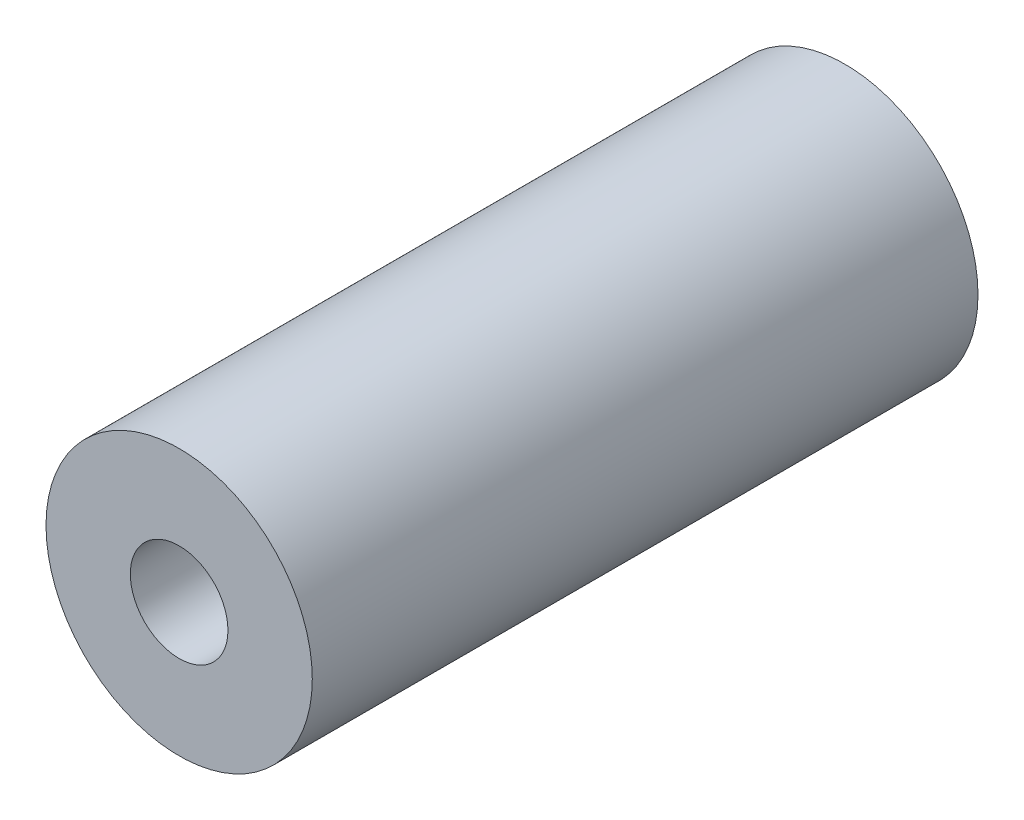
ISO-10303-21;
HEADER;
FILE_DESCRIPTION(('STEP AP214'),'2;1');
FILE_NAME('part.step','',(''),(''),'','','');
FILE_SCHEMA(('AUTOMOTIVE_DESIGN { 1 0 10303 214 1 1 1 1 }'));
ENDSEC;
DATA;
#1=APPLICATION_CONTEXT('core data for automotive mechanical design processes');
#2=APPLICATION_PROTOCOL_DEFINITION('international standard','automotive_design',2000,#1);
#3=PRODUCT_CONTEXT('',#1,'mechanical');
#4=PRODUCT('Part','Part','',(#3));
#5=PRODUCT_RELATED_PRODUCT_CATEGORY('part','',(#4));
#6=PRODUCT_DEFINITION_FORMATION('','',#4);
#7=PRODUCT_DEFINITION_CONTEXT('part definition',#1,'design');
#8=PRODUCT_DEFINITION('design','',#6,#7);
#9=PRODUCT_DEFINITION_SHAPE('','',#8);
#10=(LENGTH_UNIT() NAMED_UNIT(*) SI_UNIT(.MILLI.,.METRE.));
#11=(NAMED_UNIT(*) PLANE_ANGLE_UNIT() SI_UNIT($,.RADIAN.));
#12=(NAMED_UNIT(*) SI_UNIT($,.STERADIAN.) SOLID_ANGLE_UNIT());
#13=UNCERTAINTY_MEASURE_WITH_UNIT(LENGTH_MEASURE(1.E-05),#10,'distance_accuracy_value','');
#14=(GEOMETRIC_REPRESENTATION_CONTEXT(3) GLOBAL_UNCERTAINTY_ASSIGNED_CONTEXT((#13)) GLOBAL_UNIT_ASSIGNED_CONTEXT((#10,
#11,#12)) REPRESENTATION_CONTEXT('',''));
#15=CARTESIAN_POINT('',(0.,0.,0.));
#16=DIRECTION('',(0.,0.,1.));
#17=DIRECTION('',(1.,0.,0.));
#18=AXIS2_PLACEMENT_3D('',#15,#16,#17);
#19=CARTESIAN_POINT('',(0.,0.,30.));
#20=DIRECTION('',(0.,0.,1.));
#21=DIRECTION('',(1.,0.,0.));
#22=AXIS2_PLACEMENT_3D('',#19,#20,#21);
#23=PLANE('',#22);
#24=CARTESIAN_POINT('',(0.,0.,30.));
#25=DIRECTION('',(0.,0.,1.));
#26=DIRECTION('',(1.,0.,0.));
#27=AXIS2_PLACEMENT_3D('',#24,#25,#26);
#28=CIRCLE('',#27,6.);
#29=CARTESIAN_POINT('',(6.,0.,30.));
#30=VERTEX_POINT('',#29);
#31=EDGE_CURVE('E10',#30,#30,#28,.T.);
#32=ORIENTED_EDGE('',*,*,#31,.T.);
#33=EDGE_LOOP('',(#32));
#34=FACE_BOUND('',#33,.T.);
#35=CARTESIAN_POINT('',(0.,0.,30.));
#36=DIRECTION('',(0.,0.,1.));
#37=DIRECTION('',(1.,0.,0.));
#38=AXIS2_PLACEMENT_3D('',#35,#36,#37);
#39=CIRCLE('',#38,2.2);
#40=CARTESIAN_POINT('',(2.2,0.,30.));
#41=VERTEX_POINT('',#40);
#42=EDGE_CURVE('E42',#41,#41,#39,.T.);
#43=ORIENTED_EDGE('',*,*,#42,.F.);
#44=EDGE_LOOP('',(#43));
#45=FACE_BOUND('',#44,.T.);
#46=ADVANCED_FACE('F31',(#34,#45),#23,.T.);
#47=CARTESIAN_POINT('',(0.,0.,0.));
#48=DIRECTION('',(0.,0.,1.));
#49=DIRECTION('',(1.,0.,0.));
#50=AXIS2_PLACEMENT_3D('',#47,#48,#49);
#51=PLANE('',#50);
#52=CARTESIAN_POINT('',(0.,0.,0.));
#53=DIRECTION('',(0.,0.,1.));
#54=DIRECTION('',(1.,0.,0.));
#55=AXIS2_PLACEMENT_3D('',#52,#53,#54);
#56=CIRCLE('',#55,6.);
#57=CARTESIAN_POINT('',(6.,0.,0.));
#58=VERTEX_POINT('',#57);
#59=EDGE_CURVE('E35',#58,#58,#56,.T.);
#60=ORIENTED_EDGE('',*,*,#59,.F.);
#61=EDGE_LOOP('',(#60));
#62=FACE_BOUND('',#61,.T.);
#63=CARTESIAN_POINT('',(0.,0.,0.));
#64=DIRECTION('',(0.,0.,1.));
#65=DIRECTION('',(1.,0.,0.));
#66=AXIS2_PLACEMENT_3D('',#63,#64,#65);
#67=CIRCLE('',#66,2.2);
#68=CARTESIAN_POINT('',(2.2,0.,0.));
#69=VERTEX_POINT('',#68);
#70=EDGE_CURVE('E44',#69,#69,#67,.T.);
#71=ORIENTED_EDGE('',*,*,#70,.T.);
#72=EDGE_LOOP('',(#71));
#73=FACE_BOUND('',#72,.T.);
#74=ADVANCED_FACE('F54',(#62,#73),#51,.F.);
#75=CARTESIAN_POINT('',(0.,0.,30.));
#76=DIRECTION('',(0.,0.,-1.));
#77=DIRECTION('',(-1.,0.,0.));
#78=AXIS2_PLACEMENT_3D('',#75,#76,#77);
#79=CYLINDRICAL_SURFACE('',#78,6.);
#80=ORIENTED_EDGE('',*,*,#31,.F.);
#81=EDGE_LOOP('',(#80));
#82=FACE_BOUND('',#81,.T.);
#83=ORIENTED_EDGE('',*,*,#59,.T.);
#84=EDGE_LOOP('',(#83));
#85=FACE_BOUND('',#84,.T.);
#86=ADVANCED_FACE('F33',(#82,#85),#79,.T.);
#87=CARTESIAN_POINT('',(0.,0.,30.));
#88=DIRECTION('',(0.,0.,-1.));
#89=DIRECTION('',(-1.,0.,0.));
#90=AXIS2_PLACEMENT_3D('',#87,#88,#89);
#91=CYLINDRICAL_SURFACE('',#90,2.2);
#92=ORIENTED_EDGE('',*,*,#42,.T.);
#93=EDGE_LOOP('',(#92));
#94=FACE_BOUND('',#93,.T.);
#95=ORIENTED_EDGE('',*,*,#70,.F.);
#96=EDGE_LOOP('',(#95));
#97=FACE_BOUND('',#96,.T.);
#98=ADVANCED_FACE('F50',(#94,#97),#91,.F.);
#99=CLOSED_SHELL('',(#46,#74,#86,#98));
#100=MANIFOLD_SOLID_BREP('B2',#99);
#101=ADVANCED_BREP_SHAPE_REPRESENTATION('',(#18,#100),#14);
#102=SHAPE_DEFINITION_REPRESENTATION(#9,#101);
ENDSEC;
END-ISO-10303-21;
